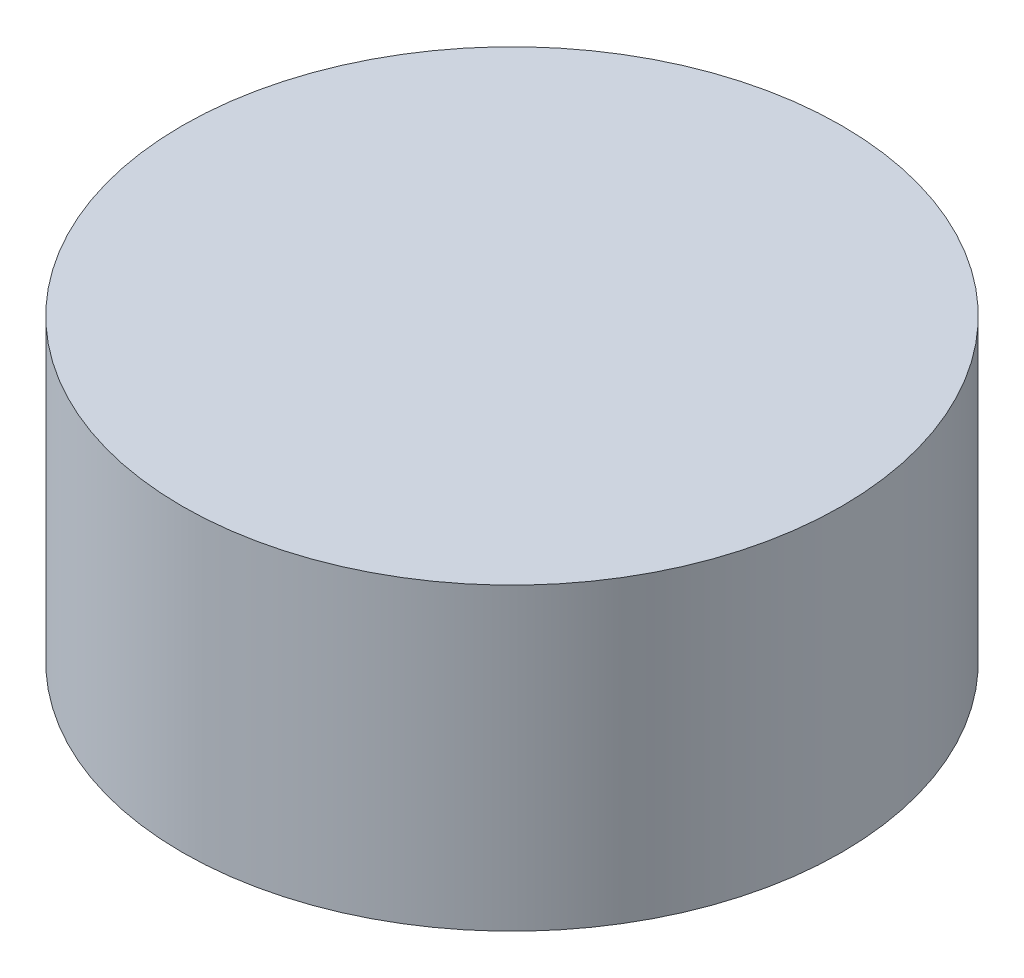
ISO-10303-21;
HEADER;
FILE_DESCRIPTION(('STEP AP214'),'2;1');
FILE_NAME('part.step','',(''),(''),'','','');
FILE_SCHEMA(('AUTOMOTIVE_DESIGN { 1 0 10303 214 1 1 1 1 }'));
ENDSEC;
DATA;
#1=APPLICATION_CONTEXT('core data for automotive mechanical design processes');
#2=APPLICATION_PROTOCOL_DEFINITION('international standard','automotive_design',2000,#1);
#3=PRODUCT_CONTEXT('',#1,'mechanical');
#4=PRODUCT('Part','Part','',(#3));
#5=PRODUCT_RELATED_PRODUCT_CATEGORY('part','',(#4));
#6=PRODUCT_DEFINITION_FORMATION('','',#4);
#7=PRODUCT_DEFINITION_CONTEXT('part definition',#1,'design');
#8=PRODUCT_DEFINITION('design','',#6,#7);
#9=PRODUCT_DEFINITION_SHAPE('','',#8);
#10=(LENGTH_UNIT() NAMED_UNIT(*) SI_UNIT(.MILLI.,.METRE.));
#11=(NAMED_UNIT(*) PLANE_ANGLE_UNIT() SI_UNIT($,.RADIAN.));
#12=(NAMED_UNIT(*) SI_UNIT($,.STERADIAN.) SOLID_ANGLE_UNIT());
#13=UNCERTAINTY_MEASURE_WITH_UNIT(LENGTH_MEASURE(1.E-05),#10,'distance_accuracy_value','');
#14=(GEOMETRIC_REPRESENTATION_CONTEXT(3) GLOBAL_UNCERTAINTY_ASSIGNED_CONTEXT((#13)) GLOBAL_UNIT_ASSIGNED_CONTEXT((#10,
#11,#12)) REPRESENTATION_CONTEXT('',''));
#15=CARTESIAN_POINT('',(0.,0.,0.));
#16=DIRECTION('',(0.,0.,1.));
#17=DIRECTION('',(1.,0.,0.));
#18=AXIS2_PLACEMENT_3D('',#15,#16,#17);
#19=CARTESIAN_POINT('',(0.,5.08,0.));
#20=DIRECTION('',(0.,-1.,0.));
#21=DIRECTION('',(0.,0.,-1.));
#22=AXIS2_PLACEMENT_3D('',#19,#20,#21);
#23=CYLINDRICAL_SURFACE('',#22,5.588);
#24=CARTESIAN_POINT('',(0.,5.08,0.));
#25=DIRECTION('',(0.,1.,0.));
#26=DIRECTION('',(0.,0.,1.));
#27=AXIS2_PLACEMENT_3D('',#24,#25,#26);
#28=CIRCLE('',#27,5.588);
#29=CARTESIAN_POINT('',(0.,5.08,5.588));
#30=VERTEX_POINT('',#29);
#31=EDGE_CURVE('E10',#30,#30,#28,.T.);
#32=ORIENTED_EDGE('',*,*,#31,.F.);
#33=EDGE_LOOP('',(#32));
#34=FACE_BOUND('',#33,.T.);
#35=CARTESIAN_POINT('',(0.,0.,0.));
#36=DIRECTION('',(0.,1.,0.));
#37=DIRECTION('',(0.,0.,1.));
#38=AXIS2_PLACEMENT_3D('',#35,#36,#37);
#39=CIRCLE('',#38,5.588);
#40=CARTESIAN_POINT('',(0.,0.,5.588));
#41=VERTEX_POINT('',#40);
#42=EDGE_CURVE('E33',#41,#41,#39,.T.);
#43=ORIENTED_EDGE('',*,*,#42,.T.);
#44=EDGE_LOOP('',(#43));
#45=FACE_BOUND('',#44,.T.);
#46=ADVANCED_FACE('F30',(#34,#45),#23,.T.);
#47=CARTESIAN_POINT('',(0.,5.08,0.));
#48=DIRECTION('',(0.,1.,0.));
#49=DIRECTION('',(0.,0.,1.));
#50=AXIS2_PLACEMENT_3D('',#47,#48,#49);
#51=PLANE('',#50);
#52=ORIENTED_EDGE('',*,*,#31,.T.);
#53=EDGE_LOOP('',(#52));
#54=FACE_BOUND('',#53,.T.);
#55=ADVANCED_FACE('F45',(#54),#51,.T.);
#56=CARTESIAN_POINT('',(0.,0.,0.));
#57=DIRECTION('',(0.,1.,0.));
#58=DIRECTION('',(0.,0.,1.));
#59=AXIS2_PLACEMENT_3D('',#56,#57,#58);
#60=PLANE('',#59);
#61=ORIENTED_EDGE('',*,*,#42,.F.);
#62=EDGE_LOOP('',(#61));
#63=FACE_BOUND('',#62,.T.);
#64=ADVANCED_FACE('F43',(#63),#60,.F.);
#65=CLOSED_SHELL('',(#46,#55,#64));
#66=MANIFOLD_SOLID_BREP('B2',#65);
#67=ADVANCED_BREP_SHAPE_REPRESENTATION('',(#18,#66),#14);
#68=SHAPE_DEFINITION_REPRESENTATION(#9,#67);
ENDSEC;
END-ISO-10303-21;
